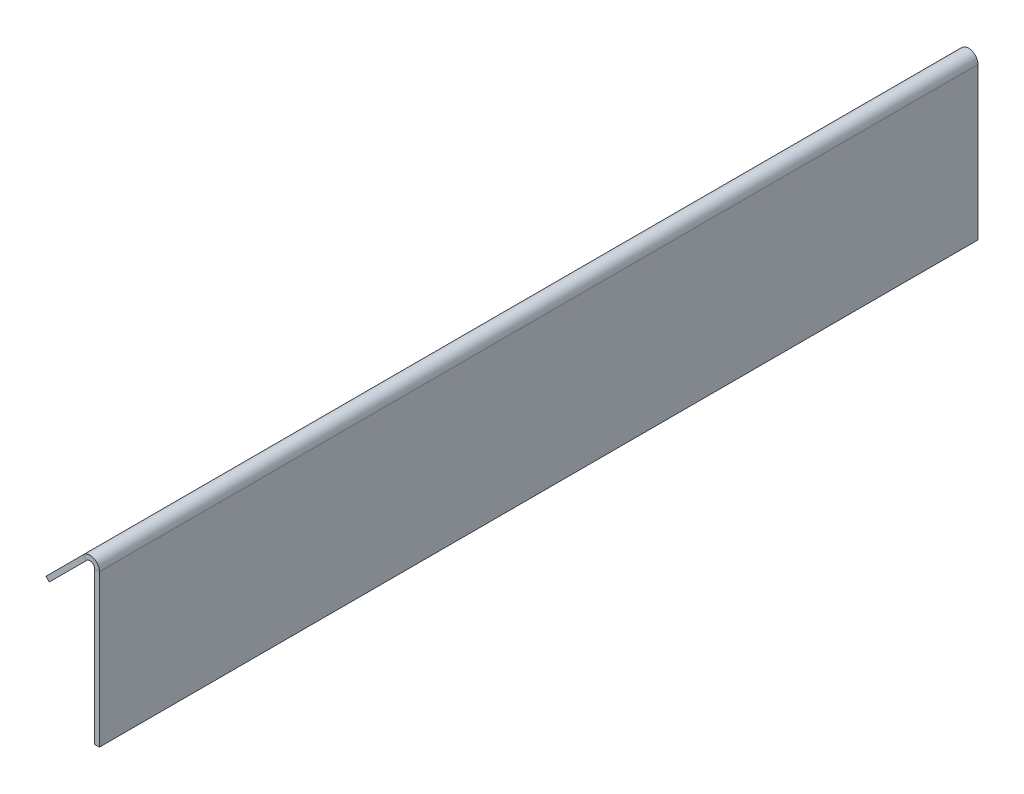
ISO-10303-21;
HEADER;
FILE_DESCRIPTION(('STEP AP214'),'2;1');
FILE_NAME('part.step','',(''),(''),'','','');
FILE_SCHEMA(('AUTOMOTIVE_DESIGN { 1 0 10303 214 1 1 1 1 }'));
ENDSEC;
DATA;
#1=APPLICATION_CONTEXT('core data for automotive mechanical design processes');
#2=APPLICATION_PROTOCOL_DEFINITION('international standard','automotive_design',2000,#1);
#3=PRODUCT_CONTEXT('',#1,'mechanical');
#4=PRODUCT('Part','Part','',(#3));
#5=PRODUCT_RELATED_PRODUCT_CATEGORY('part','',(#4));
#6=PRODUCT_DEFINITION_FORMATION('','',#4);
#7=PRODUCT_DEFINITION_CONTEXT('part definition',#1,'design');
#8=PRODUCT_DEFINITION('design','',#6,#7);
#9=PRODUCT_DEFINITION_SHAPE('','',#8);
#10=(LENGTH_UNIT() NAMED_UNIT(*) SI_UNIT(.MILLI.,.METRE.));
#11=(NAMED_UNIT(*) PLANE_ANGLE_UNIT() SI_UNIT($,.RADIAN.));
#12=(NAMED_UNIT(*) SI_UNIT($,.STERADIAN.) SOLID_ANGLE_UNIT());
#13=UNCERTAINTY_MEASURE_WITH_UNIT(LENGTH_MEASURE(1.E-05),#10,'distance_accuracy_value','');
#14=(GEOMETRIC_REPRESENTATION_CONTEXT(3) GLOBAL_UNCERTAINTY_ASSIGNED_CONTEXT((#13)) GLOBAL_UNIT_ASSIGNED_CONTEXT((#10,
#11,#12)) REPRESENTATION_CONTEXT('',''));
#15=CARTESIAN_POINT('',(0.,0.,0.));
#16=DIRECTION('',(0.,0.,1.));
#17=DIRECTION('',(1.,0.,0.));
#18=AXIS2_PLACEMENT_3D('',#15,#16,#17);
#19=CARTESIAN_POINT('',(-3.175,0.,-590.55));
#20=DIRECTION('',(0.,0.,-1.));
#21=DIRECTION('',(-1.,0.,0.));
#22=AXIS2_PLACEMENT_3D('',#19,#20,#21);
#23=PLANE('',#22);
#24=DIRECTION('',(0.,1.,0.));
#25=VECTOR('',#24,1.);
#26=CARTESIAN_POINT('',(-3.175,0.,-590.55));
#27=LINE('',#26,#25);
#28=CARTESIAN_POINT('',(-3.175,0.,-590.55));
#29=VERTEX_POINT('',#28);
#30=CARTESIAN_POINT('',(-3.175,102.144743878931,-590.55));
#31=VERTEX_POINT('',#30);
#32=EDGE_CURVE('E194',#29,#31,#27,.T.);
#33=ORIENTED_EDGE('',*,*,#32,.T.);
#34=DIRECTION('',(1.,0.,0.));
#35=VECTOR('',#34,1.);
#36=CARTESIAN_POINT('',(-3.175,102.144743878931,-590.55));
#37=LINE('',#36,#35);
#38=CARTESIAN_POINT('',(0.,102.144743878931,-590.55));
#39=VERTEX_POINT('',#38);
#40=EDGE_CURVE('E175',#31,#39,#37,.T.);
#41=ORIENTED_EDGE('',*,*,#40,.T.);
#42=DIRECTION('',(0.,1.,0.));
#43=VECTOR('',#42,1.);
#44=CARTESIAN_POINT('',(0.,0.,-590.55));
#45=LINE('',#44,#43);
#46=CARTESIAN_POINT('',(0.,0.,-590.55));
#47=VERTEX_POINT('',#46);
#48=EDGE_CURVE('E191',#47,#39,#45,.T.);
#49=ORIENTED_EDGE('',*,*,#48,.F.);
#50=DIRECTION('',(1.,0.,0.));
#51=VECTOR('',#50,1.);
#52=CARTESIAN_POINT('',(-3.175,0.,-590.55));
#53=LINE('',#52,#51);
#54=EDGE_CURVE('E13',#29,#47,#53,.T.);
#55=ORIENTED_EDGE('',*,*,#54,.F.);
#56=EDGE_LOOP('',(#33,#41,#49,#55));
#57=FACE_BOUND('',#56,.T.);
#58=ADVANCED_FACE('F61',(#57),#23,.T.);
#59=CARTESIAN_POINT('',(-3.175,0.,0.));
#60=DIRECTION('',(-1.,0.,0.));
#61=DIRECTION('',(0.,0.,1.));
#62=AXIS2_PLACEMENT_3D('',#59,#60,#61);
#63=PLANE('',#62);
#64=DIRECTION('',(0.,-1.,0.));
#65=VECTOR('',#64,1.);
#66=CARTESIAN_POINT('',(-3.175,0.,0.));
#67=LINE('',#66,#65);
#68=CARTESIAN_POINT('',(-3.175,102.144743878931,0.));
#69=VERTEX_POINT('',#68);
#70=CARTESIAN_POINT('',(-3.175,0.,0.));
#71=VERTEX_POINT('',#70);
#72=EDGE_CURVE('E188',#69,#71,#67,.T.);
#73=ORIENTED_EDGE('',*,*,#72,.F.);
#74=DIRECTION('',(0.,0.,-1.));
#75=VECTOR('',#74,1.);
#76=CARTESIAN_POINT('',(-3.175,102.144743878931,-590.55));
#77=LINE('',#76,#75);
#78=EDGE_CURVE('E76',#31,#69,#77,.F.);
#79=ORIENTED_EDGE('',*,*,#78,.F.);
#80=ORIENTED_EDGE('',*,*,#32,.F.);
#81=DIRECTION('',(0.,0.,-1.));
#82=VECTOR('',#81,1.);
#83=CARTESIAN_POINT('',(-3.175,0.,0.));
#84=LINE('',#83,#82);
#85=EDGE_CURVE('E190',#71,#29,#84,.T.);
#86=ORIENTED_EDGE('',*,*,#85,.F.);
#87=EDGE_LOOP('',(#73,#79,#80,#86));
#88=FACE_BOUND('',#87,.T.);
#89=ADVANCED_FACE('F237',(#88),#63,.T.);
#90=CARTESIAN_POINT('',(0.,0.,0.));
#91=DIRECTION('',(-1.,0.,0.));
#92=DIRECTION('',(0.,0.,1.));
#93=AXIS2_PLACEMENT_3D('',#90,#91,#92);
#94=PLANE('',#93);
#95=DIRECTION('',(0.,0.,-1.));
#96=VECTOR('',#95,1.);
#97=CARTESIAN_POINT('',(0.,102.144743878931,-590.55));
#98=LINE('',#97,#96);
#99=CARTESIAN_POINT('',(0.,102.144743878931,0.));
#100=VERTEX_POINT('',#99);
#101=EDGE_CURVE('E169',#39,#100,#98,.F.);
#102=ORIENTED_EDGE('',*,*,#101,.T.);
#103=DIRECTION('',(0.,-1.,0.));
#104=VECTOR('',#103,1.);
#105=CARTESIAN_POINT('',(0.,0.,0.));
#106=LINE('',#105,#104);
#107=CARTESIAN_POINT('',(0.,0.,0.));
#108=VERTEX_POINT('',#107);
#109=EDGE_CURVE('E186',#100,#108,#106,.T.);
#110=ORIENTED_EDGE('',*,*,#109,.T.);
#111=DIRECTION('',(0.,0.,-1.));
#112=VECTOR('',#111,1.);
#113=CARTESIAN_POINT('',(0.,0.,0.));
#114=LINE('',#113,#112);
#115=EDGE_CURVE('E197',#108,#47,#114,.T.);
#116=ORIENTED_EDGE('',*,*,#115,.T.);
#117=ORIENTED_EDGE('',*,*,#48,.T.);
#118=EDGE_LOOP('',(#102,#110,#116,#117));
#119=FACE_BOUND('',#118,.T.);
#120=ADVANCED_FACE('F204',(#119),#94,.F.);
#121=CARTESIAN_POINT('',(-3.175,0.,0.));
#122=DIRECTION('',(0.,0.,1.));
#123=DIRECTION('',(1.,0.,0.));
#124=AXIS2_PLACEMENT_3D('',#121,#122,#123);
#125=PLANE('',#124);
#126=DIRECTION('',(1.,0.,0.));
#127=VECTOR('',#126,1.);
#128=CARTESIAN_POINT('',(-3.175,102.144743878931,0.));
#129=LINE('',#128,#127);
#130=EDGE_CURVE('E84',#69,#100,#129,.T.);
#131=ORIENTED_EDGE('',*,*,#130,.F.);
#132=ORIENTED_EDGE('',*,*,#72,.T.);
#133=DIRECTION('',(1.,0.,0.));
#134=VECTOR('',#133,1.);
#135=CARTESIAN_POINT('',(-3.175,0.,0.));
#136=LINE('',#135,#134);
#137=EDGE_CURVE('E65',#71,#108,#136,.T.);
#138=ORIENTED_EDGE('',*,*,#137,.T.);
#139=ORIENTED_EDGE('',*,*,#109,.F.);
#140=EDGE_LOOP('',(#131,#132,#138,#139));
#141=FACE_BOUND('',#140,.T.);
#142=ADVANCED_FACE('F63',(#141),#125,.T.);
#143=CARTESIAN_POINT('',(-3.175,0.,0.));
#144=DIRECTION('',(0.,-1.,0.));
#145=DIRECTION('',(0.,0.,-1.));
#146=AXIS2_PLACEMENT_3D('',#143,#144,#145);
#147=PLANE('',#146);
#148=ORIENTED_EDGE('',*,*,#115,.F.);
#149=ORIENTED_EDGE('',*,*,#137,.F.);
#150=ORIENTED_EDGE('',*,*,#85,.T.);
#151=ORIENTED_EDGE('',*,*,#54,.T.);
#152=EDGE_LOOP('',(#148,#149,#150,#151));
#153=FACE_BOUND('',#152,.T.);
#154=ADVANCED_FACE('F227',(#153),#147,.T.);
#155=CARTESIAN_POINT('',(-6.35000000000001,102.144743878931,0.));
#156=DIRECTION('',(0.,0.,1.));
#157=DIRECTION('',(1.,0.,0.));
#158=AXIS2_PLACEMENT_3D('',#155,#156,#157);
#159=PLANE('',#158);
#160=DIRECTION('',(0.707106781186546,-0.707106781186549,0.));
#161=VECTOR('',#160,1.);
#162=CARTESIAN_POINT('',(-10.8401280605346,106.634871939465,0.));
#163=LINE('',#162,#161);
#164=CARTESIAN_POINT('',(-8.5950640302673,104.389807909198,0.));
#165=VERTEX_POINT('',#164);
#166=CARTESIAN_POINT('',(-10.8401280605346,106.634871939465,0.));
#167=VERTEX_POINT('',#166);
#168=EDGE_CURVE('E151',#165,#167,#163,.F.);
#169=ORIENTED_EDGE('',*,*,#168,.F.);
#170=CARTESIAN_POINT('',(-6.35000000000001,102.144743878931,0.));
#171=DIRECTION('',(0.,0.,-1.));
#172=DIRECTION('',(-1.,0.,0.));
#173=AXIS2_PLACEMENT_3D('',#170,#171,#172);
#174=CIRCLE('',#173,3.17500000000001);
#175=EDGE_CURVE('E178',#69,#165,#174,.F.);
#176=ORIENTED_EDGE('',*,*,#175,.F.);
#177=ORIENTED_EDGE('',*,*,#130,.T.);
#178=CARTESIAN_POINT('',(-6.35000000000001,102.144743878931,0.));
#179=DIRECTION('',(0.,0.,-1.));
#180=DIRECTION('',(-1.,0.,0.));
#181=AXIS2_PLACEMENT_3D('',#178,#179,#180);
#182=CIRCLE('',#181,6.35000000000001);
#183=EDGE_CURVE('E171',#100,#167,#182,.F.);
#184=ORIENTED_EDGE('',*,*,#183,.T.);
#185=EDGE_LOOP('',(#169,#176,#177,#184));
#186=FACE_BOUND('',#185,.T.);
#187=ADVANCED_FACE('F225',(#186),#159,.T.);
#188=CARTESIAN_POINT('',(-6.35000000000001,102.144743878931,-590.55));
#189=DIRECTION('',(0.,0.,1.));
#190=DIRECTION('',(1.,0.,0.));
#191=AXIS2_PLACEMENT_3D('',#188,#189,#190);
#192=PLANE('',#191);
#193=CARTESIAN_POINT('',(-6.35000000000001,102.144743878931,-590.55));
#194=DIRECTION('',(0.,0.,-1.));
#195=DIRECTION('',(-1.,0.,0.));
#196=AXIS2_PLACEMENT_3D('',#193,#194,#195);
#197=CIRCLE('',#196,3.17500000000001);
#198=CARTESIAN_POINT('',(-8.5950640302673,104.389807909198,-590.55));
#199=VERTEX_POINT('',#198);
#200=EDGE_CURVE('E182',#199,#31,#197,.T.);
#201=ORIENTED_EDGE('',*,*,#200,.F.);
#202=DIRECTION('',(0.707106781186546,-0.707106781186549,0.));
#203=VECTOR('',#202,1.);
#204=CARTESIAN_POINT('',(-8.5950640302673,104.389807909198,-590.55));
#205=LINE('',#204,#203);
#206=CARTESIAN_POINT('',(-10.8401280605346,106.634871939465,-590.55));
#207=VERTEX_POINT('',#206);
#208=EDGE_CURVE('E163',#199,#207,#205,.F.);
#209=ORIENTED_EDGE('',*,*,#208,.T.);
#210=CARTESIAN_POINT('',(-6.35000000000001,102.144743878931,-590.55));
#211=DIRECTION('',(0.,0.,-1.));
#212=DIRECTION('',(-1.,0.,0.));
#213=AXIS2_PLACEMENT_3D('',#210,#211,#212);
#214=CIRCLE('',#213,6.35000000000001);
#215=EDGE_CURVE('E172',#207,#39,#214,.T.);
#216=ORIENTED_EDGE('',*,*,#215,.T.);
#217=ORIENTED_EDGE('',*,*,#40,.F.);
#218=EDGE_LOOP('',(#201,#209,#216,#217));
#219=FACE_BOUND('',#218,.T.);
#220=ADVANCED_FACE('F213',(#219),#192,.F.);
#221=CARTESIAN_POINT('',(-6.35000000000001,102.144743878931,-590.55));
#222=DIRECTION('',(0.,0.,-1.));
#223=DIRECTION('',(-0.707106781186546,0.707106781186549,0.));
#224=AXIS2_PLACEMENT_3D('',#221,#222,#223);
#225=CYLINDRICAL_SURFACE('',#224,6.35000000000001);
#226=ORIENTED_EDGE('',*,*,#101,.F.);
#227=ORIENTED_EDGE('',*,*,#215,.F.);
#228=DIRECTION('',(0.,0.,-1.));
#229=VECTOR('',#228,1.);
#230=CARTESIAN_POINT('',(-10.8401280605346,106.634871939465,0.));
#231=LINE('',#230,#229);
#232=EDGE_CURVE('E161',#207,#167,#231,.F.);
#233=ORIENTED_EDGE('',*,*,#232,.T.);
#234=ORIENTED_EDGE('',*,*,#183,.F.);
#235=EDGE_LOOP('',(#226,#227,#233,#234));
#236=FACE_BOUND('',#235,.T.);
#237=ADVANCED_FACE('F209',(#236),#225,.T.);
#238=CARTESIAN_POINT('',(-6.35000000000001,102.144743878931,-590.55));
#239=DIRECTION('',(0.,0.,-1.));
#240=DIRECTION('',(-0.707106781186546,0.707106781186549,0.));
#241=AXIS2_PLACEMENT_3D('',#238,#239,#240);
#242=CYLINDRICAL_SURFACE('',#241,3.17500000000001);
#243=ORIENTED_EDGE('',*,*,#78,.T.);
#244=ORIENTED_EDGE('',*,*,#175,.T.);
#245=DIRECTION('',(0.,0.,-1.));
#246=VECTOR('',#245,1.);
#247=CARTESIAN_POINT('',(-8.59506403026729,104.389807909198,0.));
#248=LINE('',#247,#246);
#249=EDGE_CURVE('E166',#165,#199,#248,.T.);
#250=ORIENTED_EDGE('',*,*,#249,.T.);
#251=ORIENTED_EDGE('',*,*,#200,.T.);
#252=EDGE_LOOP('',(#243,#244,#250,#251));
#253=FACE_BOUND('',#252,.T.);
#254=ADVANCED_FACE('F222',(#253),#242,.F.);
#255=CARTESIAN_POINT('',(-35.9210244842767,81.5539755157234,-590.55));
#256=DIRECTION('',(0.,0.,1.));
#257=DIRECTION('',(1.,0.,0.));
#258=AXIS2_PLACEMENT_3D('',#255,#256,#257);
#259=PLANE('',#258);
#260=ORIENTED_EDGE('',*,*,#208,.F.);
#261=DIRECTION('',(0.707106781186549,0.707106781186546,0.));
#262=VECTOR('',#261,1.);
#263=CARTESIAN_POINT('',(-33.6759604540094,79.3089114854562,-590.55));
#264=LINE('',#263,#262);
#265=CARTESIAN_POINT('',(-33.6759604540094,79.3089114854562,-590.55));
#266=VERTEX_POINT('',#265);
#267=EDGE_CURVE('E159',#199,#266,#264,.F.);
#268=ORIENTED_EDGE('',*,*,#267,.T.);
#269=DIRECTION('',(0.707106781186546,-0.707106781186549,0.));
#270=VECTOR('',#269,1.);
#271=CARTESIAN_POINT('',(-35.9210244842767,81.5539755157234,-590.55));
#272=LINE('',#271,#270);
#273=CARTESIAN_POINT('',(-35.9210244842767,81.5539755157235,-590.55));
#274=VERTEX_POINT('',#273);
#275=EDGE_CURVE('E147',#274,#266,#272,.T.);
#276=ORIENTED_EDGE('',*,*,#275,.F.);
#277=DIRECTION('',(-0.707106781186549,-0.707106781186546,0.));
#278=VECTOR('',#277,1.);
#279=CARTESIAN_POINT('',(-60.9825640302673,56.4924359697329,-590.55));
#280=LINE('',#279,#278);
#281=EDGE_CURVE('E134',#207,#274,#280,.T.);
#282=ORIENTED_EDGE('',*,*,#281,.F.);
#283=EDGE_LOOP('',(#260,#268,#276,#282));
#284=FACE_BOUND('',#283,.T.);
#285=ADVANCED_FACE('F217',(#284),#259,.F.);
#286=CARTESIAN_POINT('',(-5.42006403026728,112.054935969733,0.));
#287=DIRECTION('',(0.,0.,-1.));
#288=DIRECTION('',(-1.,0.,0.));
#289=AXIS2_PLACEMENT_3D('',#286,#287,#288);
#290=PLANE('',#289);
#291=ORIENTED_EDGE('',*,*,#168,.T.);
#292=DIRECTION('',(0.707106781186549,0.707106781186546,0.));
#293=VECTOR('',#292,1.);
#294=CARTESIAN_POINT('',(-60.9825640302673,56.4924359697329,0.));
#295=LINE('',#294,#293);
#296=CARTESIAN_POINT('',(-35.9210244842767,81.5539755157235,0.));
#297=VERTEX_POINT('',#296);
#298=EDGE_CURVE('E132',#297,#167,#295,.T.);
#299=ORIENTED_EDGE('',*,*,#298,.F.);
#300=DIRECTION('',(0.707106781186546,-0.707106781186549,0.));
#301=VECTOR('',#300,1.);
#302=CARTESIAN_POINT('',(-35.9210244842767,81.5539755157234,0.));
#303=LINE('',#302,#301);
#304=CARTESIAN_POINT('',(-33.6759604540094,79.3089114854562,0.));
#305=VERTEX_POINT('',#304);
#306=EDGE_CURVE('E140',#297,#305,#303,.T.);
#307=ORIENTED_EDGE('',*,*,#306,.T.);
#308=DIRECTION('',(-0.707106781186549,-0.707106781186546,0.));
#309=VECTOR('',#308,1.);
#310=CARTESIAN_POINT('',(-3.17500000000001,109.809871939465,0.));
#311=LINE('',#310,#309);
#312=EDGE_CURVE('E156',#305,#165,#311,.F.);
#313=ORIENTED_EDGE('',*,*,#312,.T.);
#314=EDGE_LOOP('',(#291,#299,#307,#313));
#315=FACE_BOUND('',#314,.T.);
#316=ADVANCED_FACE('F150',(#315),#290,.F.);
#317=CARTESIAN_POINT('',(-60.9825640302673,56.4924359697329,0.));
#318=DIRECTION('',(0.707106781186546,-0.707106781186549,0.));
#319=DIRECTION('',(0.707106781186549,0.707106781186546,0.));
#320=AXIS2_PLACEMENT_3D('',#317,#318,#319);
#321=PLANE('',#320);
#322=ORIENTED_EDGE('',*,*,#232,.F.);
#323=ORIENTED_EDGE('',*,*,#281,.T.);
#324=DIRECTION('',(0.,0.,1.));
#325=VECTOR('',#324,1.);
#326=CARTESIAN_POINT('',(-35.9210244842767,81.5539755157235,0.));
#327=LINE('',#326,#325);
#328=EDGE_CURVE('E127',#274,#297,#327,.T.);
#329=ORIENTED_EDGE('',*,*,#328,.T.);
#330=ORIENTED_EDGE('',*,*,#298,.T.);
#331=EDGE_LOOP('',(#322,#323,#329,#330));
#332=FACE_BOUND('',#331,.T.);
#333=ADVANCED_FACE('F130',(#332),#321,.F.);
#334=CARTESIAN_POINT('',(-58.7375,54.2473719394656,0.));
#335=DIRECTION('',(0.707106781186546,-0.707106781186549,0.));
#336=DIRECTION('',(0.707106781186549,0.707106781186546,0.));
#337=AXIS2_PLACEMENT_3D('',#334,#335,#336);
#338=PLANE('',#337);
#339=ORIENTED_EDGE('',*,*,#267,.F.);
#340=ORIENTED_EDGE('',*,*,#249,.F.);
#341=ORIENTED_EDGE('',*,*,#312,.F.);
#342=DIRECTION('',(0.,0.,-1.));
#343=VECTOR('',#342,1.);
#344=CARTESIAN_POINT('',(-33.6759604540094,79.3089114854562,0.));
#345=LINE('',#344,#343);
#346=EDGE_CURVE('E143',#266,#305,#345,.F.);
#347=ORIENTED_EDGE('',*,*,#346,.F.);
#348=EDGE_LOOP('',(#339,#340,#341,#347));
#349=FACE_BOUND('',#348,.T.);
#350=ADVANCED_FACE('F220',(#349),#338,.T.);
#351=CARTESIAN_POINT('',(-35.9210244842767,81.5539755157234,0.));
#352=DIRECTION('',(0.707106781186549,0.707106781186546,0.));
#353=DIRECTION('',(-0.707106781186546,0.707106781186549,0.));
#354=AXIS2_PLACEMENT_3D('',#351,#352,#353);
#355=PLANE('',#354);
#356=ORIENTED_EDGE('',*,*,#346,.T.);
#357=ORIENTED_EDGE('',*,*,#306,.F.);
#358=ORIENTED_EDGE('',*,*,#328,.F.);
#359=ORIENTED_EDGE('',*,*,#275,.T.);
#360=EDGE_LOOP('',(#356,#357,#358,#359));
#361=FACE_BOUND('',#360,.T.);
#362=ADVANCED_FACE('F141',(#361),#355,.F.);
#363=CLOSED_SHELL('',(#58,#89,#120,#142,#154,#187,#220,#237,#254,#285,#316,#333,#350,#362));
#364=MANIFOLD_SOLID_BREP('B2',#363);
#365=ADVANCED_BREP_SHAPE_REPRESENTATION('',(#18,#364),#14);
#366=SHAPE_DEFINITION_REPRESENTATION(#9,#365);
ENDSEC;
END-ISO-10303-21;
